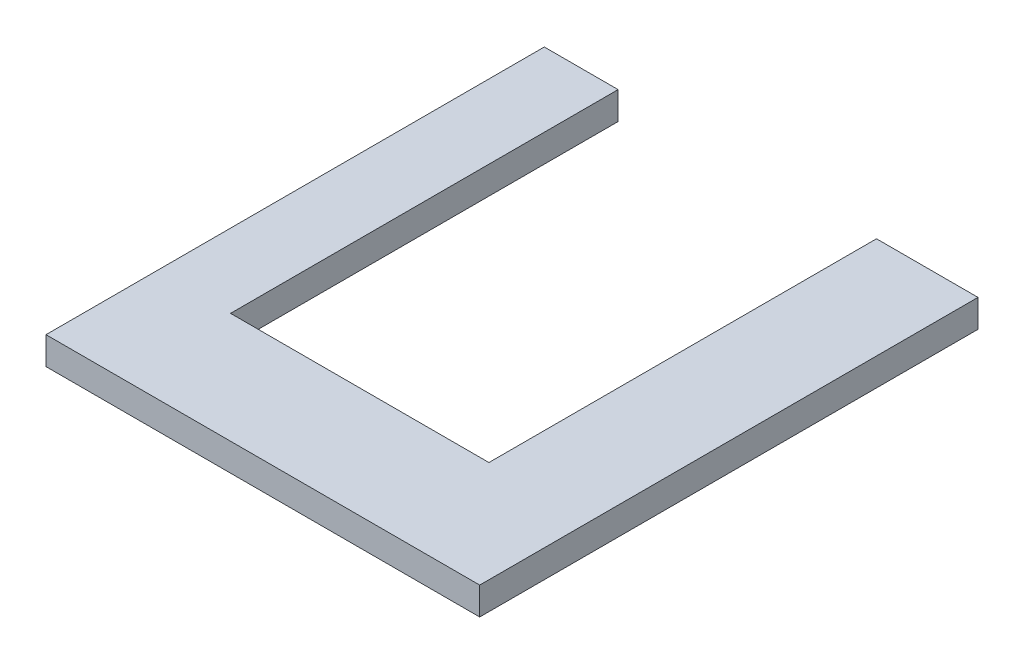
ISO-10303-21;
HEADER;
FILE_DESCRIPTION(('STEP AP214'),'2;1');
FILE_NAME('part.step','',(''),(''),'','','');
FILE_SCHEMA(('AUTOMOTIVE_DESIGN { 1 0 10303 214 1 1 1 1 }'));
ENDSEC;
DATA;
#1=APPLICATION_CONTEXT('core data for automotive mechanical design processes');
#2=APPLICATION_PROTOCOL_DEFINITION('international standard','automotive_design',2000,#1);
#3=PRODUCT_CONTEXT('',#1,'mechanical');
#4=PRODUCT('Part','Part','',(#3));
#5=PRODUCT_RELATED_PRODUCT_CATEGORY('part','',(#4));
#6=PRODUCT_DEFINITION_FORMATION('','',#4);
#7=PRODUCT_DEFINITION_CONTEXT('part definition',#1,'design');
#8=PRODUCT_DEFINITION('design','',#6,#7);
#9=PRODUCT_DEFINITION_SHAPE('','',#8);
#10=(LENGTH_UNIT() NAMED_UNIT(*) SI_UNIT(.MILLI.,.METRE.));
#11=(NAMED_UNIT(*) PLANE_ANGLE_UNIT() SI_UNIT($,.RADIAN.));
#12=(NAMED_UNIT(*) SI_UNIT($,.STERADIAN.) SOLID_ANGLE_UNIT());
#13=UNCERTAINTY_MEASURE_WITH_UNIT(LENGTH_MEASURE(1.E-05),#10,'distance_accuracy_value','');
#14=(GEOMETRIC_REPRESENTATION_CONTEXT(3) GLOBAL_UNCERTAINTY_ASSIGNED_CONTEXT((#13)) GLOBAL_UNIT_ASSIGNED_CONTEXT((#10,
#11,#12)) REPRESENTATION_CONTEXT('',''));
#15=CARTESIAN_POINT('',(0.,0.,0.));
#16=DIRECTION('',(0.,0.,1.));
#17=DIRECTION('',(1.,0.,0.));
#18=AXIS2_PLACEMENT_3D('',#15,#16,#17);
#19=CARTESIAN_POINT('',(0.,0.,0.));
#20=DIRECTION('',(0.,0.,-1.));
#21=DIRECTION('',(-1.,0.,0.));
#22=AXIS2_PLACEMENT_3D('',#19,#20,#21);
#23=PLANE('',#22);
#24=DIRECTION('',(0.,1.,0.));
#25=VECTOR('',#24,1.);
#26=CARTESIAN_POINT('',(400.,0.,1.11022302462516E-13));
#27=LINE('',#26,#25);
#28=CARTESIAN_POINT('',(400.,0.,1.11022302462516E-13));
#29=VERTEX_POINT('',#28);
#30=CARTESIAN_POINT('',(400.,150.,1.11022302462516E-13));
#31=VERTEX_POINT('',#30);
#32=EDGE_CURVE('E148',#29,#31,#27,.T.);
#33=ORIENTED_EDGE('',*,*,#32,.F.);
#34=DIRECTION('',(1.,0.,0.));
#35=VECTOR('',#34,1.);
#36=CARTESIAN_POINT('',(0.,0.,0.));
#37=LINE('',#36,#35);
#38=CARTESIAN_POINT('',(0.,0.,0.));
#39=VERTEX_POINT('',#38);
#40=EDGE_CURVE('E135',#39,#29,#37,.T.);
#41=ORIENTED_EDGE('',*,*,#40,.F.);
#42=DIRECTION('',(0.,-1.,0.));
#43=VECTOR('',#42,1.);
#44=CARTESIAN_POINT('',(0.,0.,0.));
#45=LINE('',#44,#43);
#46=CARTESIAN_POINT('',(0.,150.,0.));
#47=VERTEX_POINT('',#46);
#48=EDGE_CURVE('E151',#47,#39,#45,.T.);
#49=ORIENTED_EDGE('',*,*,#48,.F.);
#50=DIRECTION('',(-1.,0.,0.));
#51=VECTOR('',#50,1.);
#52=CARTESIAN_POINT('',(0.,150.,0.));
#53=LINE('',#52,#51);
#54=EDGE_CURVE('E84',#31,#47,#53,.T.);
#55=ORIENTED_EDGE('',*,*,#54,.F.);
#56=EDGE_LOOP('',(#33,#41,#49,#55));
#57=FACE_BOUND('',#56,.T.);
#58=ADVANCED_FACE('F38',(#57),#23,.T.);
#59=CARTESIAN_POINT('',(0.,0.,2700.));
#60=DIRECTION('',(1.,0.,0.));
#61=DIRECTION('',(0.,0.,-1.));
#62=AXIS2_PLACEMENT_3D('',#59,#60,#61);
#63=PLANE('',#62);
#64=ORIENTED_EDGE('',*,*,#48,.T.);
#65=DIRECTION('',(0.,0.,-1.));
#66=VECTOR('',#65,1.);
#67=CARTESIAN_POINT('',(0.,0.,2700.));
#68=LINE('',#67,#66);
#69=CARTESIAN_POINT('',(0.,0.,2700.));
#70=VERTEX_POINT('',#69);
#71=EDGE_CURVE('E11',#70,#39,#68,.T.);
#72=ORIENTED_EDGE('',*,*,#71,.F.);
#73=DIRECTION('',(0.,-1.,0.));
#74=VECTOR('',#73,1.);
#75=CARTESIAN_POINT('',(0.,0.,2700.));
#76=LINE('',#75,#74);
#77=CARTESIAN_POINT('',(0.,150.,2700.));
#78=VERTEX_POINT('',#77);
#79=EDGE_CURVE('E157',#78,#70,#76,.T.);
#80=ORIENTED_EDGE('',*,*,#79,.F.);
#81=DIRECTION('',(0.,0.,-1.));
#82=VECTOR('',#81,1.);
#83=CARTESIAN_POINT('',(0.,150.,2700.));
#84=LINE('',#83,#82);
#85=EDGE_CURVE('E168',#78,#47,#84,.T.);
#86=ORIENTED_EDGE('',*,*,#85,.T.);
#87=EDGE_LOOP('',(#64,#72,#80,#86));
#88=FACE_BOUND('',#87,.T.);
#89=ADVANCED_FACE('F40',(#88),#63,.F.);
#90=CARTESIAN_POINT('',(0.,0.,2700.));
#91=DIRECTION('',(0.,1.,0.));
#92=DIRECTION('',(0.,0.,1.));
#93=AXIS2_PLACEMENT_3D('',#90,#91,#92);
#94=PLANE('',#93);
#95=ORIENTED_EDGE('',*,*,#40,.T.);
#96=DIRECTION('',(0.,0.,1.));
#97=VECTOR('',#96,1.);
#98=CARTESIAN_POINT('',(400.,0.,1.11022302462516E-13));
#99=LINE('',#98,#97);
#100=CARTESIAN_POINT('',(400.,0.,2100.));
#101=VERTEX_POINT('',#100);
#102=EDGE_CURVE('E116',#29,#101,#99,.T.);
#103=ORIENTED_EDGE('',*,*,#102,.T.);
#104=DIRECTION('',(1.,0.,0.));
#105=VECTOR('',#104,1.);
#106=CARTESIAN_POINT('',(400.,0.,2100.));
#107=LINE('',#106,#105);
#108=CARTESIAN_POINT('',(1800.,0.,2100.));
#109=VERTEX_POINT('',#108);
#110=EDGE_CURVE('E127',#101,#109,#107,.T.);
#111=ORIENTED_EDGE('',*,*,#110,.T.);
#112=DIRECTION('',(0.,0.,-1.));
#113=VECTOR('',#112,1.);
#114=CARTESIAN_POINT('',(1800.,0.,0.));
#115=LINE('',#114,#113);
#116=CARTESIAN_POINT('',(1800.,0.,0.));
#117=VERTEX_POINT('',#116);
#118=EDGE_CURVE('E124',#109,#117,#115,.T.);
#119=ORIENTED_EDGE('',*,*,#118,.T.);
#120=CARTESIAN_POINT('',(2350.,0.,0.));
#121=VERTEX_POINT('',#120);
#122=EDGE_CURVE('E172',#117,#121,#37,.T.);
#123=ORIENTED_EDGE('',*,*,#122,.T.);
#124=DIRECTION('',(0.,0.,-1.));
#125=VECTOR('',#124,1.);
#126=CARTESIAN_POINT('',(2350.,0.,2700.));
#127=LINE('',#126,#125);
#128=CARTESIAN_POINT('',(2350.,0.,2700.));
#129=VERTEX_POINT('',#128);
#130=EDGE_CURVE('E47',#129,#121,#127,.T.);
#131=ORIENTED_EDGE('',*,*,#130,.F.);
#132=DIRECTION('',(1.,0.,0.));
#133=VECTOR('',#132,1.);
#134=CARTESIAN_POINT('',(0.,0.,2700.));
#135=LINE('',#134,#133);
#136=EDGE_CURVE('E91',#70,#129,#135,.T.);
#137=ORIENTED_EDGE('',*,*,#136,.F.);
#138=ORIENTED_EDGE('',*,*,#71,.T.);
#139=EDGE_LOOP('',(#95,#103,#111,#119,#123,#131,#137,#138));
#140=FACE_BOUND('',#139,.T.);
#141=ADVANCED_FACE('F134',(#140),#94,.F.);
#142=CARTESIAN_POINT('',(2350.,0.,2700.));
#143=DIRECTION('',(-1.,0.,0.));
#144=DIRECTION('',(0.,0.,1.));
#145=AXIS2_PLACEMENT_3D('',#142,#143,#144);
#146=PLANE('',#145);
#147=DIRECTION('',(0.,1.,0.));
#148=VECTOR('',#147,1.);
#149=CARTESIAN_POINT('',(2350.,0.,0.));
#150=LINE('',#149,#148);
#151=CARTESIAN_POINT('',(2350.,150.,0.));
#152=VERTEX_POINT('',#151);
#153=EDGE_CURVE('E175',#121,#152,#150,.T.);
#154=ORIENTED_EDGE('',*,*,#153,.T.);
#155=DIRECTION('',(0.,0.,-1.));
#156=VECTOR('',#155,1.);
#157=CARTESIAN_POINT('',(2350.,150.,2700.));
#158=LINE('',#157,#156);
#159=CARTESIAN_POINT('',(2350.,150.,2700.));
#160=VERTEX_POINT('',#159);
#161=EDGE_CURVE('E183',#160,#152,#158,.T.);
#162=ORIENTED_EDGE('',*,*,#161,.F.);
#163=DIRECTION('',(0.,1.,0.));
#164=VECTOR('',#163,1.);
#165=CARTESIAN_POINT('',(2350.,0.,2700.));
#166=LINE('',#165,#164);
#167=EDGE_CURVE('E163',#129,#160,#166,.T.);
#168=ORIENTED_EDGE('',*,*,#167,.F.);
#169=ORIENTED_EDGE('',*,*,#130,.T.);
#170=EDGE_LOOP('',(#154,#162,#168,#169));
#171=FACE_BOUND('',#170,.T.);
#172=ADVANCED_FACE('F191',(#171),#146,.F.);
#173=CARTESIAN_POINT('',(0.,150.,2700.));
#174=DIRECTION('',(0.,-1.,0.));
#175=DIRECTION('',(0.,0.,-1.));
#176=AXIS2_PLACEMENT_3D('',#173,#174,#175);
#177=PLANE('',#176);
#178=DIRECTION('',(1.,0.,0.));
#179=VECTOR('',#178,1.);
#180=CARTESIAN_POINT('',(400.,150.,2100.));
#181=LINE('',#180,#179);
#182=CARTESIAN_POINT('',(400.,150.,2100.));
#183=VERTEX_POINT('',#182);
#184=CARTESIAN_POINT('',(1800.,150.,2100.));
#185=VERTEX_POINT('',#184);
#186=EDGE_CURVE('E139',#183,#185,#181,.T.);
#187=ORIENTED_EDGE('',*,*,#186,.F.);
#188=DIRECTION('',(0.,0.,1.));
#189=VECTOR('',#188,1.);
#190=CARTESIAN_POINT('',(400.,150.,1.11022302462516E-13));
#191=LINE('',#190,#189);
#192=EDGE_CURVE('E118',#31,#183,#191,.T.);
#193=ORIENTED_EDGE('',*,*,#192,.F.);
#194=ORIENTED_EDGE('',*,*,#54,.T.);
#195=ORIENTED_EDGE('',*,*,#85,.F.);
#196=DIRECTION('',(-1.,0.,0.));
#197=VECTOR('',#196,1.);
#198=CARTESIAN_POINT('',(0.,150.,2700.));
#199=LINE('',#198,#197);
#200=EDGE_CURVE('E63',#160,#78,#199,.T.);
#201=ORIENTED_EDGE('',*,*,#200,.F.);
#202=ORIENTED_EDGE('',*,*,#161,.T.);
#203=CARTESIAN_POINT('',(1800.,150.,0.));
#204=VERTEX_POINT('',#203);
#205=EDGE_CURVE('E160',#152,#204,#53,.T.);
#206=ORIENTED_EDGE('',*,*,#205,.T.);
#207=DIRECTION('',(0.,0.,-1.));
#208=VECTOR('',#207,1.);
#209=CARTESIAN_POINT('',(1800.,150.,0.));
#210=LINE('',#209,#208);
#211=EDGE_CURVE('E54',#185,#204,#210,.T.);
#212=ORIENTED_EDGE('',*,*,#211,.F.);
#213=EDGE_LOOP('',(#187,#193,#194,#195,#201,#202,#206,#212));
#214=FACE_BOUND('',#213,.T.);
#215=ADVANCED_FACE('F197',(#214),#177,.F.);
#216=CARTESIAN_POINT('',(0.,0.,2700.));
#217=DIRECTION('',(0.,0.,-1.));
#218=DIRECTION('',(-1.,0.,0.));
#219=AXIS2_PLACEMENT_3D('',#216,#217,#218);
#220=PLANE('',#219);
#221=ORIENTED_EDGE('',*,*,#79,.T.);
#222=ORIENTED_EDGE('',*,*,#136,.T.);
#223=ORIENTED_EDGE('',*,*,#167,.T.);
#224=ORIENTED_EDGE('',*,*,#200,.T.);
#225=EDGE_LOOP('',(#221,#222,#223,#224));
#226=FACE_BOUND('',#225,.T.);
#227=ADVANCED_FACE('F202',(#226),#220,.F.);
#228=DIRECTION('',(0.,1.,0.));
#229=VECTOR('',#228,1.);
#230=CARTESIAN_POINT('',(1800.,0.,0.));
#231=LINE('',#230,#229);
#232=EDGE_CURVE('E152',#117,#204,#231,.T.);
#233=ORIENTED_EDGE('',*,*,#232,.T.);
#234=ORIENTED_EDGE('',*,*,#205,.F.);
#235=ORIENTED_EDGE('',*,*,#153,.F.);
#236=ORIENTED_EDGE('',*,*,#122,.F.);
#237=EDGE_LOOP('',(#233,#234,#235,#236));
#238=FACE_BOUND('',#237,.T.);
#239=ADVANCED_FACE('F196',(#238),#23,.T.);
#240=CARTESIAN_POINT('',(400.,0.,1.11022302462516E-13));
#241=DIRECTION('',(-1.,0.,0.));
#242=DIRECTION('',(0.,0.,1.));
#243=AXIS2_PLACEMENT_3D('',#240,#241,#242);
#244=PLANE('',#243);
#245=ORIENTED_EDGE('',*,*,#192,.T.);
#246=DIRECTION('',(0.,1.,0.));
#247=VECTOR('',#246,1.);
#248=CARTESIAN_POINT('',(400.,0.,2100.));
#249=LINE('',#248,#247);
#250=EDGE_CURVE('E112',#101,#183,#249,.T.);
#251=ORIENTED_EDGE('',*,*,#250,.F.);
#252=ORIENTED_EDGE('',*,*,#102,.F.);
#253=ORIENTED_EDGE('',*,*,#32,.T.);
#254=EDGE_LOOP('',(#245,#251,#252,#253));
#255=FACE_BOUND('',#254,.T.);
#256=ADVANCED_FACE('F114',(#255),#244,.F.);
#257=CARTESIAN_POINT('',(1800.,0.,0.));
#258=DIRECTION('',(1.,0.,0.));
#259=DIRECTION('',(0.,0.,-1.));
#260=AXIS2_PLACEMENT_3D('',#257,#258,#259);
#261=PLANE('',#260);
#262=ORIENTED_EDGE('',*,*,#211,.T.);
#263=ORIENTED_EDGE('',*,*,#232,.F.);
#264=ORIENTED_EDGE('',*,*,#118,.F.);
#265=DIRECTION('',(0.,1.,0.));
#266=VECTOR('',#265,1.);
#267=CARTESIAN_POINT('',(1800.,0.,2100.));
#268=LINE('',#267,#266);
#269=EDGE_CURVE('E123',#109,#185,#268,.T.);
#270=ORIENTED_EDGE('',*,*,#269,.T.);
#271=EDGE_LOOP('',(#262,#263,#264,#270));
#272=FACE_BOUND('',#271,.T.);
#273=ADVANCED_FACE('F238',(#272),#261,.F.);
#274=CARTESIAN_POINT('',(400.,0.,2100.));
#275=DIRECTION('',(0.,0.,1.));
#276=DIRECTION('',(1.,0.,0.));
#277=AXIS2_PLACEMENT_3D('',#274,#275,#276);
#278=PLANE('',#277);
#279=ORIENTED_EDGE('',*,*,#186,.T.);
#280=ORIENTED_EDGE('',*,*,#269,.F.);
#281=ORIENTED_EDGE('',*,*,#110,.F.);
#282=ORIENTED_EDGE('',*,*,#250,.T.);
#283=EDGE_LOOP('',(#279,#280,#281,#282));
#284=FACE_BOUND('',#283,.T.);
#285=ADVANCED_FACE('F128',(#284),#278,.F.);
#286=CLOSED_SHELL('',(#58,#89,#141,#172,#215,#227,#239,#256,#273,#285));
#287=MANIFOLD_SOLID_BREP('B2',#286);
#288=ADVANCED_BREP_SHAPE_REPRESENTATION('',(#18,#287),#14);
#289=SHAPE_DEFINITION_REPRESENTATION(#9,#288);
ENDSEC;
END-ISO-10303-21;
